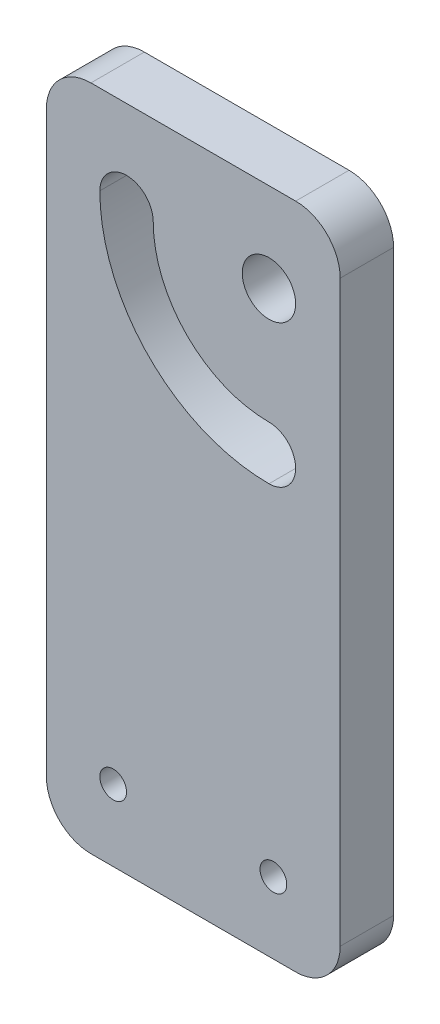
ISO-10303-21;
HEADER;
FILE_DESCRIPTION(('STEP AP214'),'2;1');
FILE_NAME('part.step','',(''),(''),'','','');
FILE_SCHEMA(('AUTOMOTIVE_DESIGN { 1 0 10303 214 1 1 1 1 }'));
ENDSEC;
DATA;
#1=APPLICATION_CONTEXT('core data for automotive mechanical design processes');
#2=APPLICATION_PROTOCOL_DEFINITION('international standard','automotive_design',2000,#1);
#3=PRODUCT_CONTEXT('',#1,'mechanical');
#4=PRODUCT('Part','Part','',(#3));
#5=PRODUCT_RELATED_PRODUCT_CATEGORY('part','',(#4));
#6=PRODUCT_DEFINITION_FORMATION('','',#4);
#7=PRODUCT_DEFINITION_CONTEXT('part definition',#1,'design');
#8=PRODUCT_DEFINITION('design','',#6,#7);
#9=PRODUCT_DEFINITION_SHAPE('','',#8);
#10=(LENGTH_UNIT() NAMED_UNIT(*) SI_UNIT(.MILLI.,.METRE.));
#11=(NAMED_UNIT(*) PLANE_ANGLE_UNIT() SI_UNIT($,.RADIAN.));
#12=(NAMED_UNIT(*) SI_UNIT($,.STERADIAN.) SOLID_ANGLE_UNIT());
#13=UNCERTAINTY_MEASURE_WITH_UNIT(LENGTH_MEASURE(1.E-05),#10,'distance_accuracy_value','');
#14=(GEOMETRIC_REPRESENTATION_CONTEXT(3) GLOBAL_UNCERTAINTY_ASSIGNED_CONTEXT((#13)) GLOBAL_UNIT_ASSIGNED_CONTEXT((#10,
#11,#12)) REPRESENTATION_CONTEXT('',''));
#15=CARTESIAN_POINT('',(0.,0.,0.));
#16=DIRECTION('',(0.,0.,1.));
#17=DIRECTION('',(1.,0.,0.));
#18=AXIS2_PLACEMENT_3D('',#15,#16,#17);
#19=CARTESIAN_POINT('',(28.,-20.,6.));
#20=DIRECTION('',(0.,0.,1.));
#21=DIRECTION('',(1.,0.,0.));
#22=AXIS2_PLACEMENT_3D('',#19,#20,#21);
#23=PLANE('',#22);
#24=CARTESIAN_POINT('',(25.,40.,6.));
#25=DIRECTION('',(0.,0.,1.));
#26=DIRECTION('',(1.,0.,0.));
#27=AXIS2_PLACEMENT_3D('',#24,#25,#26);
#28=CIRCLE('',#27,19.);
#29=CARTESIAN_POINT('',(6.,40.0000000000001,6.));
#30=VERTEX_POINT('',#29);
#31=CARTESIAN_POINT('',(25.,21.,6.));
#32=VERTEX_POINT('',#31);
#33=EDGE_CURVE('E133',#30,#32,#28,.T.);
#34=ORIENTED_EDGE('',*,*,#33,.F.);
#35=CARTESIAN_POINT('',(9.,40.0000000000001,6.));
#36=DIRECTION('',(0.,0.,1.));
#37=DIRECTION('',(1.,0.,0.));
#38=AXIS2_PLACEMENT_3D('',#35,#36,#37);
#39=CIRCLE('',#38,3.);
#40=CARTESIAN_POINT('',(12.,40.,6.));
#41=VERTEX_POINT('',#40);
#42=EDGE_CURVE('E125',#41,#30,#39,.T.);
#43=ORIENTED_EDGE('',*,*,#42,.F.);
#44=CARTESIAN_POINT('',(25.,40.,6.));
#45=DIRECTION('',(0.,0.,-1.));
#46=DIRECTION('',(1.,0.,0.));
#47=AXIS2_PLACEMENT_3D('',#44,#45,#46);
#48=CIRCLE('',#47,13.);
#49=CARTESIAN_POINT('',(25.,27.,6.));
#50=VERTEX_POINT('',#49);
#51=EDGE_CURVE('E148',#50,#41,#48,.T.);
#52=ORIENTED_EDGE('',*,*,#51,.F.);
#53=CARTESIAN_POINT('',(25.,24.,6.));
#54=DIRECTION('',(0.,0.,1.));
#55=DIRECTION('',(1.,0.,0.));
#56=AXIS2_PLACEMENT_3D('',#53,#54,#55);
#57=CIRCLE('',#56,3.);
#58=EDGE_CURVE('E146',#32,#50,#57,.T.);
#59=ORIENTED_EDGE('',*,*,#58,.F.);
#60=EDGE_LOOP('',(#34,#43,#52,#59));
#61=FACE_BOUND('',#60,.T.);
#62=CARTESIAN_POINT('',(25.,40.,6.));
#63=DIRECTION('',(0.,0.,1.));
#64=DIRECTION('',(1.,0.,0.));
#65=AXIS2_PLACEMENT_3D('',#62,#63,#64);
#66=CIRCLE('',#65,3.);
#67=CARTESIAN_POINT('',(28.,40.,6.));
#68=VERTEX_POINT('',#67);
#69=EDGE_CURVE('E176',#68,#68,#66,.T.);
#70=ORIENTED_EDGE('',*,*,#69,.F.);
#71=EDGE_LOOP('',(#70));
#72=FACE_BOUND('',#71,.T.);
#73=CARTESIAN_POINT('',(28.,-20.,6.));
#74=DIRECTION('',(0.,0.,1.));
#75=DIRECTION('',(1.,0.,0.));
#76=AXIS2_PLACEMENT_3D('',#73,#74,#75);
#77=CIRCLE('',#76,5.00000000000001);
#78=CARTESIAN_POINT('',(28.,-25.,6.));
#79=VERTEX_POINT('',#78);
#80=CARTESIAN_POINT('',(33.,-20.,6.));
#81=VERTEX_POINT('',#80);
#82=EDGE_CURVE('E195',#79,#81,#77,.T.);
#83=ORIENTED_EDGE('',*,*,#82,.T.);
#84=DIRECTION('',(0.,1.,0.));
#85=VECTOR('',#84,1.);
#86=CARTESIAN_POINT('',(33.,45.,6.));
#87=LINE('',#86,#85);
#88=CARTESIAN_POINT('',(33.,45.,6.));
#89=VERTEX_POINT('',#88);
#90=EDGE_CURVE('E198',#81,#89,#87,.T.);
#91=ORIENTED_EDGE('',*,*,#90,.T.);
#92=CARTESIAN_POINT('',(28.,45.,6.));
#93=DIRECTION('',(0.,0.,1.));
#94=DIRECTION('',(-1.,0.,0.));
#95=AXIS2_PLACEMENT_3D('',#92,#93,#94);
#96=CIRCLE('',#95,5.);
#97=CARTESIAN_POINT('',(28.,50.,6.));
#98=VERTEX_POINT('',#97);
#99=EDGE_CURVE('E201',#89,#98,#96,.T.);
#100=ORIENTED_EDGE('',*,*,#99,.T.);
#101=DIRECTION('',(-1.,0.,0.));
#102=VECTOR('',#101,1.);
#103=CARTESIAN_POINT('',(5.00000000000004,50.,6.));
#104=LINE('',#103,#102);
#105=CARTESIAN_POINT('',(5.00000000000003,50.,6.));
#106=VERTEX_POINT('',#105);
#107=EDGE_CURVE('E203',#98,#106,#104,.T.);
#108=ORIENTED_EDGE('',*,*,#107,.T.);
#109=CARTESIAN_POINT('',(5.,45.,6.));
#110=DIRECTION('',(0.,0.,1.));
#111=DIRECTION('',(-1.,0.,0.));
#112=AXIS2_PLACEMENT_3D('',#109,#110,#111);
#113=CIRCLE('',#112,5.);
#114=CARTESIAN_POINT('',(0.,45.,6.));
#115=VERTEX_POINT('',#114);
#116=EDGE_CURVE('E205',#106,#115,#113,.T.);
#117=ORIENTED_EDGE('',*,*,#116,.T.);
#118=DIRECTION('',(0.,-1.,0.));
#119=VECTOR('',#118,1.);
#120=CARTESIAN_POINT('',(0.,45.,6.));
#121=LINE('',#120,#119);
#122=CARTESIAN_POINT('',(0.,-20.,6.));
#123=VERTEX_POINT('',#122);
#124=EDGE_CURVE('E207',#115,#123,#121,.T.);
#125=ORIENTED_EDGE('',*,*,#124,.T.);
#126=CARTESIAN_POINT('',(5.,-20.,6.));
#127=DIRECTION('',(0.,0.,1.));
#128=DIRECTION('',(-1.,0.,0.));
#129=AXIS2_PLACEMENT_3D('',#126,#127,#128);
#130=CIRCLE('',#129,5.);
#131=CARTESIAN_POINT('',(5.,-25.,6.));
#132=VERTEX_POINT('',#131);
#133=EDGE_CURVE('E209',#123,#132,#130,.T.);
#134=ORIENTED_EDGE('',*,*,#133,.T.);
#135=DIRECTION('',(1.,0.,0.));
#136=VECTOR('',#135,1.);
#137=CARTESIAN_POINT('',(5.,-25.,6.));
#138=LINE('',#137,#136);
#139=EDGE_CURVE('E211',#132,#79,#138,.T.);
#140=ORIENTED_EDGE('',*,*,#139,.T.);
#141=EDGE_LOOP('',(#83,#91,#100,#108,#117,#125,#134,#140));
#142=FACE_BOUND('',#141,.T.);
#143=CARTESIAN_POINT('',(25.5,-17.,6.));
#144=DIRECTION('',(0.,0.,1.));
#145=DIRECTION('',(1.,0.,0.));
#146=AXIS2_PLACEMENT_3D('',#143,#144,#145);
#147=CIRCLE('',#146,1.5);
#148=CARTESIAN_POINT('',(27.,-17.,6.));
#149=VERTEX_POINT('',#148);
#150=EDGE_CURVE('E184',#149,#149,#147,.T.);
#151=ORIENTED_EDGE('',*,*,#150,.F.);
#152=EDGE_LOOP('',(#151));
#153=FACE_BOUND('',#152,.T.);
#154=CARTESIAN_POINT('',(7.49999999999999,-17.,6.));
#155=DIRECTION('',(0.,0.,1.));
#156=DIRECTION('',(-1.,0.,0.));
#157=AXIS2_PLACEMENT_3D('',#154,#155,#156);
#158=CIRCLE('',#157,1.5);
#159=CARTESIAN_POINT('',(5.99999999999999,-17.,6.));
#160=VERTEX_POINT('',#159);
#161=EDGE_CURVE('E155',#160,#160,#158,.T.);
#162=ORIENTED_EDGE('',*,*,#161,.F.);
#163=EDGE_LOOP('',(#162));
#164=FACE_BOUND('',#163,.T.);
#165=ADVANCED_FACE('F36',(#61,#72,#142,#153,#164),#23,.T.);
#166=CARTESIAN_POINT('',(28.,-20.,0.));
#167=DIRECTION('',(0.,0.,1.));
#168=DIRECTION('',(1.,0.,0.));
#169=AXIS2_PLACEMENT_3D('',#166,#167,#168);
#170=PLANE('',#169);
#171=CARTESIAN_POINT('',(25.,40.,0.));
#172=DIRECTION('',(0.,0.,1.));
#173=DIRECTION('',(1.,0.,0.));
#174=AXIS2_PLACEMENT_3D('',#171,#172,#173);
#175=CIRCLE('',#174,3.);
#176=CARTESIAN_POINT('',(28.,40.,0.));
#177=VERTEX_POINT('',#176);
#178=EDGE_CURVE('E141',#177,#177,#175,.T.);
#179=ORIENTED_EDGE('',*,*,#178,.T.);
#180=EDGE_LOOP('',(#179));
#181=FACE_BOUND('',#180,.T.);
#182=CARTESIAN_POINT('',(25.5,-17.,0.));
#183=DIRECTION('',(0.,0.,1.));
#184=DIRECTION('',(1.,0.,0.));
#185=AXIS2_PLACEMENT_3D('',#182,#183,#184);
#186=CIRCLE('',#185,1.5);
#187=CARTESIAN_POINT('',(27.,-17.,0.));
#188=VERTEX_POINT('',#187);
#189=EDGE_CURVE('E179',#188,#188,#186,.T.);
#190=ORIENTED_EDGE('',*,*,#189,.T.);
#191=EDGE_LOOP('',(#190));
#192=FACE_BOUND('',#191,.T.);
#193=CARTESIAN_POINT('',(28.,-20.,0.));
#194=DIRECTION('',(0.,0.,1.));
#195=DIRECTION('',(1.,0.,0.));
#196=AXIS2_PLACEMENT_3D('',#193,#194,#195);
#197=CIRCLE('',#196,5.00000000000001);
#198=CARTESIAN_POINT('',(28.,-25.,0.));
#199=VERTEX_POINT('',#198);
#200=CARTESIAN_POINT('',(33.,-20.,0.));
#201=VERTEX_POINT('',#200);
#202=EDGE_CURVE('E213',#199,#201,#197,.T.);
#203=ORIENTED_EDGE('',*,*,#202,.F.);
#204=DIRECTION('',(1.,0.,0.));
#205=VECTOR('',#204,1.);
#206=CARTESIAN_POINT('',(5.,-25.,0.));
#207=LINE('',#206,#205);
#208=CARTESIAN_POINT('',(5.,-25.,0.));
#209=VERTEX_POINT('',#208);
#210=EDGE_CURVE('E199',#209,#199,#207,.T.);
#211=ORIENTED_EDGE('',*,*,#210,.F.);
#212=CARTESIAN_POINT('',(5.,-20.,0.));
#213=DIRECTION('',(0.,0.,1.));
#214=DIRECTION('',(-1.,0.,0.));
#215=AXIS2_PLACEMENT_3D('',#212,#213,#214);
#216=CIRCLE('',#215,5.);
#217=CARTESIAN_POINT('',(0.,-20.,0.));
#218=VERTEX_POINT('',#217);
#219=EDGE_CURVE('E240',#218,#209,#216,.T.);
#220=ORIENTED_EDGE('',*,*,#219,.F.);
#221=DIRECTION('',(0.,-1.,0.));
#222=VECTOR('',#221,1.);
#223=CARTESIAN_POINT('',(0.,45.,0.));
#224=LINE('',#223,#222);
#225=CARTESIAN_POINT('',(0.,45.,0.));
#226=VERTEX_POINT('',#225);
#227=EDGE_CURVE('E236',#226,#218,#224,.T.);
#228=ORIENTED_EDGE('',*,*,#227,.F.);
#229=CARTESIAN_POINT('',(5.,45.,0.));
#230=DIRECTION('',(0.,0.,1.));
#231=DIRECTION('',(-1.,0.,0.));
#232=AXIS2_PLACEMENT_3D('',#229,#230,#231);
#233=CIRCLE('',#232,5.);
#234=CARTESIAN_POINT('',(5.00000000000003,50.,0.));
#235=VERTEX_POINT('',#234);
#236=EDGE_CURVE('E233',#235,#226,#233,.T.);
#237=ORIENTED_EDGE('',*,*,#236,.F.);
#238=DIRECTION('',(-1.,0.,0.));
#239=VECTOR('',#238,1.);
#240=CARTESIAN_POINT('',(5.00000000000004,50.,0.));
#241=LINE('',#240,#239);
#242=CARTESIAN_POINT('',(28.,50.,0.));
#243=VERTEX_POINT('',#242);
#244=EDGE_CURVE('E225',#243,#235,#241,.T.);
#245=ORIENTED_EDGE('',*,*,#244,.F.);
#246=CARTESIAN_POINT('',(28.,45.,0.));
#247=DIRECTION('',(0.,0.,1.));
#248=DIRECTION('',(-1.,0.,0.));
#249=AXIS2_PLACEMENT_3D('',#246,#247,#248);
#250=CIRCLE('',#249,5.);
#251=CARTESIAN_POINT('',(33.,45.,0.));
#252=VERTEX_POINT('',#251);
#253=EDGE_CURVE('E221',#252,#243,#250,.T.);
#254=ORIENTED_EDGE('',*,*,#253,.F.);
#255=DIRECTION('',(0.,1.,0.));
#256=VECTOR('',#255,1.);
#257=CARTESIAN_POINT('',(33.,45.,0.));
#258=LINE('',#257,#256);
#259=EDGE_CURVE('E217',#201,#252,#258,.T.);
#260=ORIENTED_EDGE('',*,*,#259,.F.);
#261=EDGE_LOOP('',(#203,#211,#220,#228,#237,#245,#254,#260));
#262=FACE_BOUND('',#261,.T.);
#263=CARTESIAN_POINT('',(9.,40.0000000000001,0.));
#264=DIRECTION('',(0.,0.,1.));
#265=DIRECTION('',(1.,0.,0.));
#266=AXIS2_PLACEMENT_3D('',#263,#264,#265);
#267=CIRCLE('',#266,3.);
#268=CARTESIAN_POINT('',(12.,40.,0.));
#269=VERTEX_POINT('',#268);
#270=CARTESIAN_POINT('',(6.,40.0000000000001,0.));
#271=VERTEX_POINT('',#270);
#272=EDGE_CURVE('E59',#269,#271,#267,.T.);
#273=ORIENTED_EDGE('',*,*,#272,.T.);
#274=CARTESIAN_POINT('',(25.,40.,0.));
#275=DIRECTION('',(0.,0.,1.));
#276=DIRECTION('',(1.,0.,0.));
#277=AXIS2_PLACEMENT_3D('',#274,#275,#276);
#278=CIRCLE('',#277,19.);
#279=CARTESIAN_POINT('',(25.,21.,0.));
#280=VERTEX_POINT('',#279);
#281=EDGE_CURVE('E140',#271,#280,#278,.T.);
#282=ORIENTED_EDGE('',*,*,#281,.T.);
#283=CARTESIAN_POINT('',(25.,24.,0.));
#284=DIRECTION('',(0.,0.,1.));
#285=DIRECTION('',(1.,0.,0.));
#286=AXIS2_PLACEMENT_3D('',#283,#284,#285);
#287=CIRCLE('',#286,3.);
#288=CARTESIAN_POINT('',(25.,27.,0.));
#289=VERTEX_POINT('',#288);
#290=EDGE_CURVE('E165',#280,#289,#287,.T.);
#291=ORIENTED_EDGE('',*,*,#290,.T.);
#292=CARTESIAN_POINT('',(25.,40.,0.));
#293=DIRECTION('',(0.,0.,-1.));
#294=DIRECTION('',(1.,0.,0.));
#295=AXIS2_PLACEMENT_3D('',#292,#293,#294);
#296=CIRCLE('',#295,13.);
#297=EDGE_CURVE('E134',#289,#269,#296,.T.);
#298=ORIENTED_EDGE('',*,*,#297,.T.);
#299=EDGE_LOOP('',(#273,#282,#291,#298));
#300=FACE_BOUND('',#299,.T.);
#301=CARTESIAN_POINT('',(7.49999999999999,-17.,0.));
#302=DIRECTION('',(0.,0.,1.));
#303=DIRECTION('',(-1.,0.,0.));
#304=AXIS2_PLACEMENT_3D('',#301,#302,#303);
#305=CIRCLE('',#304,1.5);
#306=CARTESIAN_POINT('',(5.99999999999999,-17.,0.));
#307=VERTEX_POINT('',#306);
#308=EDGE_CURVE('E283',#307,#307,#305,.T.);
#309=ORIENTED_EDGE('',*,*,#308,.T.);
#310=EDGE_LOOP('',(#309));
#311=FACE_BOUND('',#310,.T.);
#312=ADVANCED_FACE('F274',(#181,#192,#262,#300,#311),#170,.F.);
#313=CARTESIAN_POINT('',(28.,-20.,6.));
#314=DIRECTION('',(0.,0.,-1.));
#315=DIRECTION('',(-1.,0.,0.));
#316=AXIS2_PLACEMENT_3D('',#313,#314,#315);
#317=CYLINDRICAL_SURFACE('',#316,5.00000000000001);
#318=ORIENTED_EDGE('',*,*,#202,.T.);
#319=DIRECTION('',(0.,0.,-1.));
#320=VECTOR('',#319,1.);
#321=CARTESIAN_POINT('',(33.,-20.,6.));
#322=LINE('',#321,#320);
#323=EDGE_CURVE('E12',#81,#201,#322,.T.);
#324=ORIENTED_EDGE('',*,*,#323,.F.);
#325=ORIENTED_EDGE('',*,*,#82,.F.);
#326=DIRECTION('',(0.,0.,-1.));
#327=VECTOR('',#326,1.);
#328=CARTESIAN_POINT('',(28.,-25.,6.));
#329=LINE('',#328,#327);
#330=EDGE_CURVE('E212',#79,#199,#329,.T.);
#331=ORIENTED_EDGE('',*,*,#330,.T.);
#332=EDGE_LOOP('',(#318,#324,#325,#331));
#333=FACE_BOUND('',#332,.T.);
#334=ADVANCED_FACE('F38',(#333),#317,.T.);
#335=CARTESIAN_POINT('',(33.,45.,6.));
#336=DIRECTION('',(-1.,0.,0.));
#337=DIRECTION('',(0.,-1.,0.));
#338=AXIS2_PLACEMENT_3D('',#335,#336,#337);
#339=PLANE('',#338);
#340=ORIENTED_EDGE('',*,*,#259,.T.);
#341=DIRECTION('',(0.,0.,-1.));
#342=VECTOR('',#341,1.);
#343=CARTESIAN_POINT('',(33.,45.,6.));
#344=LINE('',#343,#342);
#345=EDGE_CURVE('E44',#89,#252,#344,.T.);
#346=ORIENTED_EDGE('',*,*,#345,.F.);
#347=ORIENTED_EDGE('',*,*,#90,.F.);
#348=ORIENTED_EDGE('',*,*,#323,.T.);
#349=EDGE_LOOP('',(#340,#346,#347,#348));
#350=FACE_BOUND('',#349,.T.);
#351=ADVANCED_FACE('F326',(#350),#339,.F.);
#352=CARTESIAN_POINT('',(28.,45.,6.));
#353=DIRECTION('',(0.,0.,-1.));
#354=DIRECTION('',(-1.,0.,0.));
#355=AXIS2_PLACEMENT_3D('',#352,#353,#354);
#356=CYLINDRICAL_SURFACE('',#355,5.);
#357=ORIENTED_EDGE('',*,*,#253,.T.);
#358=DIRECTION('',(0.,0.,-1.));
#359=VECTOR('',#358,1.);
#360=CARTESIAN_POINT('',(28.,50.,6.));
#361=LINE('',#360,#359);
#362=EDGE_CURVE('E261',#98,#243,#361,.T.);
#363=ORIENTED_EDGE('',*,*,#362,.F.);
#364=ORIENTED_EDGE('',*,*,#99,.F.);
#365=ORIENTED_EDGE('',*,*,#345,.T.);
#366=EDGE_LOOP('',(#357,#363,#364,#365));
#367=FACE_BOUND('',#366,.T.);
#368=ADVANCED_FACE('F268',(#367),#356,.T.);
#369=CARTESIAN_POINT('',(5.00000000000004,50.,6.));
#370=DIRECTION('',(0.,-1.,0.));
#371=DIRECTION('',(0.,0.,-1.));
#372=AXIS2_PLACEMENT_3D('',#369,#370,#371);
#373=PLANE('',#372);
#374=ORIENTED_EDGE('',*,*,#244,.T.);
#375=DIRECTION('',(0.,0.,-1.));
#376=VECTOR('',#375,1.);
#377=CARTESIAN_POINT('',(5.00000000000003,50.,6.));
#378=LINE('',#377,#376);
#379=EDGE_CURVE('E258',#106,#235,#378,.T.);
#380=ORIENTED_EDGE('',*,*,#379,.F.);
#381=ORIENTED_EDGE('',*,*,#107,.F.);
#382=ORIENTED_EDGE('',*,*,#362,.T.);
#383=EDGE_LOOP('',(#374,#380,#381,#382));
#384=FACE_BOUND('',#383,.T.);
#385=ADVANCED_FACE('F321',(#384),#373,.F.);
#386=CARTESIAN_POINT('',(5.,45.,6.));
#387=DIRECTION('',(0.,0.,-1.));
#388=DIRECTION('',(-1.,0.,0.));
#389=AXIS2_PLACEMENT_3D('',#386,#387,#388);
#390=CYLINDRICAL_SURFACE('',#389,5.);
#391=ORIENTED_EDGE('',*,*,#236,.T.);
#392=DIRECTION('',(0.,0.,-1.));
#393=VECTOR('',#392,1.);
#394=CARTESIAN_POINT('',(0.,45.,6.));
#395=LINE('',#394,#393);
#396=EDGE_CURVE('E255',#115,#226,#395,.T.);
#397=ORIENTED_EDGE('',*,*,#396,.F.);
#398=ORIENTED_EDGE('',*,*,#116,.F.);
#399=ORIENTED_EDGE('',*,*,#379,.T.);
#400=EDGE_LOOP('',(#391,#397,#398,#399));
#401=FACE_BOUND('',#400,.T.);
#402=ADVANCED_FACE('F317',(#401),#390,.T.);
#403=CARTESIAN_POINT('',(0.,45.,6.));
#404=DIRECTION('',(1.,0.,0.));
#405=DIRECTION('',(0.,1.,0.));
#406=AXIS2_PLACEMENT_3D('',#403,#404,#405);
#407=PLANE('',#406);
#408=ORIENTED_EDGE('',*,*,#227,.T.);
#409=DIRECTION('',(0.,0.,-1.));
#410=VECTOR('',#409,1.);
#411=CARTESIAN_POINT('',(0.,-20.,6.));
#412=LINE('',#411,#410);
#413=EDGE_CURVE('E252',#123,#218,#412,.T.);
#414=ORIENTED_EDGE('',*,*,#413,.F.);
#415=ORIENTED_EDGE('',*,*,#124,.F.);
#416=ORIENTED_EDGE('',*,*,#396,.T.);
#417=EDGE_LOOP('',(#408,#414,#415,#416));
#418=FACE_BOUND('',#417,.T.);
#419=ADVANCED_FACE('F313',(#418),#407,.F.);
#420=CARTESIAN_POINT('',(5.,-20.,6.));
#421=DIRECTION('',(0.,0.,-1.));
#422=DIRECTION('',(-1.,0.,0.));
#423=AXIS2_PLACEMENT_3D('',#420,#421,#422);
#424=CYLINDRICAL_SURFACE('',#423,5.);
#425=ORIENTED_EDGE('',*,*,#219,.T.);
#426=DIRECTION('',(0.,0.,-1.));
#427=VECTOR('',#426,1.);
#428=CARTESIAN_POINT('',(5.,-25.,6.));
#429=LINE('',#428,#427);
#430=EDGE_CURVE('E249',#132,#209,#429,.T.);
#431=ORIENTED_EDGE('',*,*,#430,.F.);
#432=ORIENTED_EDGE('',*,*,#133,.F.);
#433=ORIENTED_EDGE('',*,*,#413,.T.);
#434=EDGE_LOOP('',(#425,#431,#432,#433));
#435=FACE_BOUND('',#434,.T.);
#436=ADVANCED_FACE('F309',(#435),#424,.T.);
#437=CARTESIAN_POINT('',(5.,-25.,6.));
#438=DIRECTION('',(0.,1.,0.));
#439=DIRECTION('',(0.,0.,1.));
#440=AXIS2_PLACEMENT_3D('',#437,#438,#439);
#441=PLANE('',#440);
#442=ORIENTED_EDGE('',*,*,#210,.T.);
#443=ORIENTED_EDGE('',*,*,#330,.F.);
#444=ORIENTED_EDGE('',*,*,#139,.F.);
#445=ORIENTED_EDGE('',*,*,#430,.T.);
#446=EDGE_LOOP('',(#442,#443,#444,#445));
#447=FACE_BOUND('',#446,.T.);
#448=ADVANCED_FACE('F306',(#447),#441,.F.);
#449=CARTESIAN_POINT('',(25.5,-17.,6.));
#450=DIRECTION('',(0.,0.,-1.));
#451=DIRECTION('',(-1.,0.,0.));
#452=AXIS2_PLACEMENT_3D('',#449,#450,#451);
#453=CYLINDRICAL_SURFACE('',#452,1.5);
#454=ORIENTED_EDGE('',*,*,#150,.T.);
#455=EDGE_LOOP('',(#454));
#456=FACE_BOUND('',#455,.T.);
#457=ORIENTED_EDGE('',*,*,#189,.F.);
#458=EDGE_LOOP('',(#457));
#459=FACE_BOUND('',#458,.T.);
#460=ADVANCED_FACE('F303',(#456,#459),#453,.F.);
#461=CARTESIAN_POINT('',(25.,40.,6.));
#462=DIRECTION('',(0.,0.,-1.));
#463=DIRECTION('',(-1.,0.,0.));
#464=AXIS2_PLACEMENT_3D('',#461,#462,#463);
#465=CYLINDRICAL_SURFACE('',#464,3.);
#466=ORIENTED_EDGE('',*,*,#69,.T.);
#467=EDGE_LOOP('',(#466));
#468=FACE_BOUND('',#467,.T.);
#469=ORIENTED_EDGE('',*,*,#178,.F.);
#470=EDGE_LOOP('',(#469));
#471=FACE_BOUND('',#470,.T.);
#472=ADVANCED_FACE('F352',(#468,#471),#465,.F.);
#473=CARTESIAN_POINT('',(9.,40.0000000000001,6.));
#474=DIRECTION('',(0.,0.,-1.));
#475=DIRECTION('',(-1.,0.,0.));
#476=AXIS2_PLACEMENT_3D('',#473,#474,#475);
#477=CYLINDRICAL_SURFACE('',#476,3.);
#478=ORIENTED_EDGE('',*,*,#272,.F.);
#479=DIRECTION('',(0.,0.,-1.));
#480=VECTOR('',#479,1.);
#481=CARTESIAN_POINT('',(12.,40.,6.));
#482=LINE('',#481,#480);
#483=EDGE_CURVE('E129',#41,#269,#482,.T.);
#484=ORIENTED_EDGE('',*,*,#483,.F.);
#485=ORIENTED_EDGE('',*,*,#42,.T.);
#486=DIRECTION('',(0.,0.,-1.));
#487=VECTOR('',#486,1.);
#488=CARTESIAN_POINT('',(6.,40.0000000000001,6.));
#489=LINE('',#488,#487);
#490=EDGE_CURVE('E128',#30,#271,#489,.T.);
#491=ORIENTED_EDGE('',*,*,#490,.T.);
#492=EDGE_LOOP('',(#478,#484,#485,#491));
#493=FACE_BOUND('',#492,.T.);
#494=ADVANCED_FACE('F127',(#493),#477,.F.);
#495=CARTESIAN_POINT('',(25.,40.,6.));
#496=DIRECTION('',(0.,0.,-1.));
#497=DIRECTION('',(-1.,0.,0.));
#498=AXIS2_PLACEMENT_3D('',#495,#496,#497);
#499=CYLINDRICAL_SURFACE('',#498,19.);
#500=ORIENTED_EDGE('',*,*,#281,.F.);
#501=ORIENTED_EDGE('',*,*,#490,.F.);
#502=ORIENTED_EDGE('',*,*,#33,.T.);
#503=DIRECTION('',(0.,0.,-1.));
#504=VECTOR('',#503,1.);
#505=CARTESIAN_POINT('',(25.,21.,6.));
#506=LINE('',#505,#504);
#507=EDGE_CURVE('E142',#32,#280,#506,.T.);
#508=ORIENTED_EDGE('',*,*,#507,.T.);
#509=EDGE_LOOP('',(#500,#501,#502,#508));
#510=FACE_BOUND('',#509,.T.);
#511=ADVANCED_FACE('F137',(#510),#499,.F.);
#512=CARTESIAN_POINT('',(25.,24.,6.));
#513=DIRECTION('',(0.,0.,-1.));
#514=DIRECTION('',(-1.,0.,0.));
#515=AXIS2_PLACEMENT_3D('',#512,#513,#514);
#516=CYLINDRICAL_SURFACE('',#515,3.);
#517=ORIENTED_EDGE('',*,*,#290,.F.);
#518=ORIENTED_EDGE('',*,*,#507,.F.);
#519=ORIENTED_EDGE('',*,*,#58,.T.);
#520=DIRECTION('',(0.,0.,-1.));
#521=VECTOR('',#520,1.);
#522=CARTESIAN_POINT('',(25.,27.,6.));
#523=LINE('',#522,#521);
#524=EDGE_CURVE('E51',#50,#289,#523,.T.);
#525=ORIENTED_EDGE('',*,*,#524,.T.);
#526=EDGE_LOOP('',(#517,#518,#519,#525));
#527=FACE_BOUND('',#526,.T.);
#528=ADVANCED_FACE('F367',(#527),#516,.F.);
#529=CARTESIAN_POINT('',(25.,40.,6.));
#530=DIRECTION('',(0.,0.,-1.));
#531=DIRECTION('',(-1.,0.,0.));
#532=AXIS2_PLACEMENT_3D('',#529,#530,#531);
#533=CYLINDRICAL_SURFACE('',#532,13.);
#534=ORIENTED_EDGE('',*,*,#297,.F.);
#535=ORIENTED_EDGE('',*,*,#524,.F.);
#536=ORIENTED_EDGE('',*,*,#51,.T.);
#537=ORIENTED_EDGE('',*,*,#483,.T.);
#538=EDGE_LOOP('',(#534,#535,#536,#537));
#539=FACE_BOUND('',#538,.T.);
#540=ADVANCED_FACE('F370',(#539),#533,.T.);
#541=CARTESIAN_POINT('',(7.49999999999999,-17.,6.));
#542=DIRECTION('',(0.,0.,-1.));
#543=DIRECTION('',(-1.,0.,0.));
#544=AXIS2_PLACEMENT_3D('',#541,#542,#543);
#545=CYLINDRICAL_SURFACE('',#544,1.5);
#546=ORIENTED_EDGE('',*,*,#161,.T.);
#547=EDGE_LOOP('',(#546));
#548=FACE_BOUND('',#547,.T.);
#549=ORIENTED_EDGE('',*,*,#308,.F.);
#550=EDGE_LOOP('',(#549));
#551=FACE_BOUND('',#550,.T.);
#552=ADVANCED_FACE('F292',(#548,#551),#545,.F.);
#553=CLOSED_SHELL('',(#165,#312,#334,#351,#368,#385,#402,#419,#436,#448,#460,#472,#494,#511,
#528,#540,#552));
#554=MANIFOLD_SOLID_BREP('B2',#553);
#555=ADVANCED_BREP_SHAPE_REPRESENTATION('',(#18,#554),#14);
#556=SHAPE_DEFINITION_REPRESENTATION(#9,#555);
ENDSEC;
END-ISO-10303-21;
